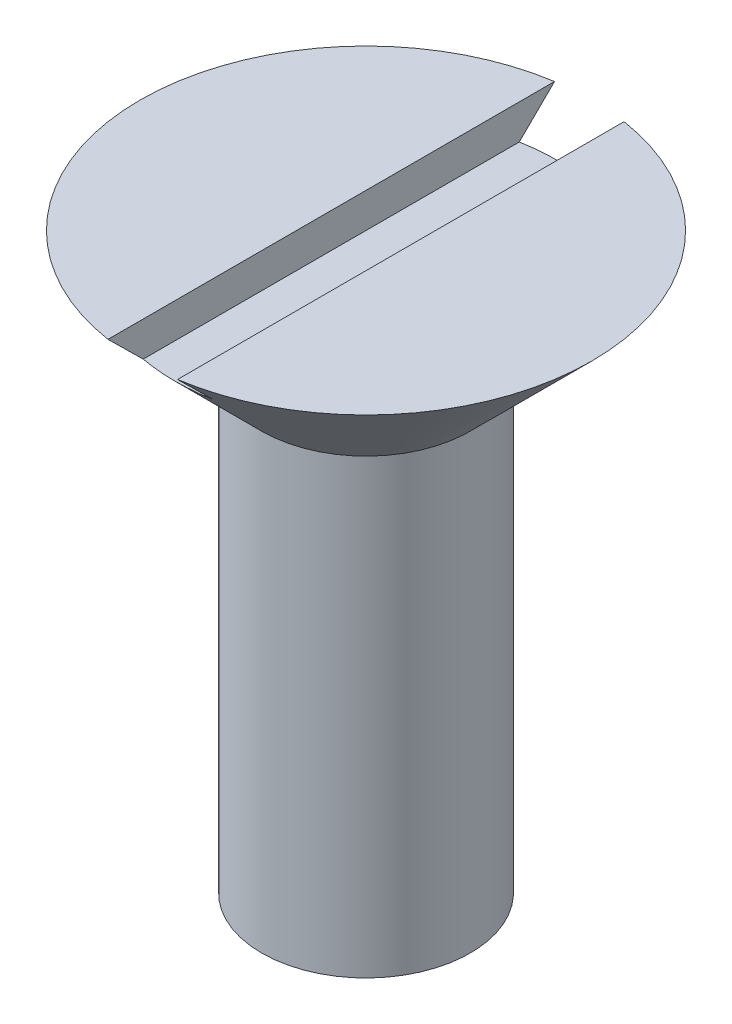
ISO-10303-21;
HEADER;
FILE_DESCRIPTION(('STEP AP214'),'2;1');
FILE_NAME('part.step','',(''),(''),'','','');
FILE_SCHEMA(('AUTOMOTIVE_DESIGN { 1 0 10303 214 1 1 1 1 }'));
ENDSEC;
DATA;
#1=APPLICATION_CONTEXT('core data for automotive mechanical design processes');
#2=APPLICATION_PROTOCOL_DEFINITION('international standard','automotive_design',2000,#1);
#3=PRODUCT_CONTEXT('',#1,'mechanical');
#4=PRODUCT('Part','Part','',(#3));
#5=PRODUCT_RELATED_PRODUCT_CATEGORY('part','',(#4));
#6=PRODUCT_DEFINITION_FORMATION('','',#4);
#7=PRODUCT_DEFINITION_CONTEXT('part definition',#1,'design');
#8=PRODUCT_DEFINITION('design','',#6,#7);
#9=PRODUCT_DEFINITION_SHAPE('','',#8);
#10=(LENGTH_UNIT() NAMED_UNIT(*) SI_UNIT(.MILLI.,.METRE.));
#11=(NAMED_UNIT(*) PLANE_ANGLE_UNIT() SI_UNIT($,.RADIAN.));
#12=(NAMED_UNIT(*) SI_UNIT($,.STERADIAN.) SOLID_ANGLE_UNIT());
#13=UNCERTAINTY_MEASURE_WITH_UNIT(LENGTH_MEASURE(1.E-05),#10,'distance_accuracy_value','');
#14=(GEOMETRIC_REPRESENTATION_CONTEXT(3) GLOBAL_UNCERTAINTY_ASSIGNED_CONTEXT((#13)) GLOBAL_UNIT_ASSIGNED_CONTEXT((#10,
#11,#12)) REPRESENTATION_CONTEXT('',''));
#15=CARTESIAN_POINT('',(0.,0.,0.));
#16=DIRECTION('',(0.,0.,1.));
#17=DIRECTION('',(1.,0.,0.));
#18=AXIS2_PLACEMENT_3D('',#15,#16,#17);
#19=CARTESIAN_POINT('',(6.5,18.2320508075688,0.));
#20=DIRECTION('',(0.,-1.,0.));
#21=DIRECTION('',(0.,0.,-1.));
#22=AXIS2_PLACEMENT_3D('',#19,#20,#21);
#23=PLANE('',#22);
#24=CARTESIAN_POINT('',(0.,18.2320508075689,0.));
#25=DIRECTION('',(0.,1.,0.));
#26=DIRECTION('',(0.,0.,1.));
#27=AXIS2_PLACEMENT_3D('',#24,#25,#26);
#28=CIRCLE('',#27,6.5);
#29=CARTESIAN_POINT('',(-1.,18.2320508075689,-6.42261628933256));
#30=VERTEX_POINT('',#29);
#31=CARTESIAN_POINT('',(-1.,18.2320508075689,6.42261628933256));
#32=VERTEX_POINT('',#31);
#33=EDGE_CURVE('E109',#30,#32,#28,.T.);
#34=ORIENTED_EDGE('',*,*,#33,.T.);
#35=DIRECTION('',(0.,0.,-1.));
#36=VECTOR('',#35,1.);
#37=CARTESIAN_POINT('',(-1.,18.2320508075688,0.));
#38=LINE('',#37,#36);
#39=EDGE_CURVE('E99',#32,#30,#38,.T.);
#40=ORIENTED_EDGE('',*,*,#39,.T.);
#41=EDGE_LOOP('',(#34,#40));
#42=FACE_BOUND('',#41,.T.);
#43=ADVANCED_FACE('F38',(#42),#23,.F.);
#44=CARTESIAN_POINT('',(0.,18.2320508075688,0.));
#45=DIRECTION('',(0.,1.,0.));
#46=DIRECTION('',(0.,0.,1.));
#47=AXIS2_PLACEMENT_3D('',#44,#45,#46);
#48=CYLINDRICAL_SURFACE('',#47,3.);
#49=CARTESIAN_POINT('',(0.,14.7320508075689,0.));
#50=DIRECTION('',(0.,1.,0.));
#51=DIRECTION('',(0.,0.,1.));
#52=AXIS2_PLACEMENT_3D('',#49,#50,#51);
#53=CIRCLE('',#52,3.);
#54=CARTESIAN_POINT('',(0.,14.7320508075689,3.));
#55=VERTEX_POINT('',#54);
#56=EDGE_CURVE('E103',#55,#55,#53,.T.);
#57=ORIENTED_EDGE('',*,*,#56,.F.);
#58=EDGE_LOOP('',(#57));
#59=FACE_BOUND('',#58,.T.);
#60=CARTESIAN_POINT('',(0.,1.73205080756885,0.));
#61=DIRECTION('',(0.,1.,0.));
#62=DIRECTION('',(0.,0.,1.));
#63=AXIS2_PLACEMENT_3D('',#60,#61,#62);
#64=CIRCLE('',#63,3.);
#65=CARTESIAN_POINT('',(0.,1.73205080756885,3.));
#66=VERTEX_POINT('',#65);
#67=EDGE_CURVE('E111',#66,#66,#64,.T.);
#68=ORIENTED_EDGE('',*,*,#67,.T.);
#69=EDGE_LOOP('',(#68));
#70=FACE_BOUND('',#69,.T.);
#71=ADVANCED_FACE('F40',(#59,#70),#48,.T.);
#72=CARTESIAN_POINT('',(0.,14.7320508075689,0.));
#73=DIRECTION('',(0.,1.,0.));
#74=DIRECTION('',(0.,0.,1.));
#75=AXIS2_PLACEMENT_3D('',#72,#73,#74);
#76=CONICAL_SURFACE('',#75,3.,0.785398163397448);
#77=CARTESIAN_POINT('',(0.,17.2320508075689,0.));
#78=DIRECTION('',(0.,-1.,0.));
#79=DIRECTION('',(0.,0.,-1.));
#80=AXIS2_PLACEMENT_3D('',#77,#78,#79);
#81=CIRCLE('',#80,5.5);
#82=CARTESIAN_POINT('',(1.,17.2320508075689,5.40832691319598));
#83=VERTEX_POINT('',#82);
#84=CARTESIAN_POINT('',(-1.,17.2320508075689,5.40832691319598));
#85=VERTEX_POINT('',#84);
#86=EDGE_CURVE('E12',#83,#85,#81,.T.);
#87=ORIENTED_EDGE('',*,*,#86,.T.);
#88=CARTESIAN_POINT('',(-1.,18.2327508075689,-6.42332472244709));
#89=CARTESIAN_POINT('',(-1.,18.048258314838,-6.23660097945427));
#90=CARTESIAN_POINT('',(-1.,17.8638535420667,-6.04979042026791));
#91=CARTESIAN_POINT('',(-1.,17.4951834773058,-5.67580075194415));
#92=CARTESIAN_POINT('',(-1.,17.3109183452467,-5.48862148517341));
#93=CARTESIAN_POINT('',(-1.,16.9405719228406,-5.11174427199789));
#94=CARTESIAN_POINT('',(-1.,16.7544945705618,-4.92204245247594));
#95=CARTESIAN_POINT('',(-1.,16.3829423371827,-4.54228085926047));
#96=CARTESIAN_POINT('',(-0.999999999999999,16.1974671533208,-4.3522213816307));
#97=CARTESIAN_POINT('',(-0.999999999999999,15.7523765807063,-3.89448779308013));
#98=CARTESIAN_POINT('',(-0.999999999999999,15.4930928757865,-3.62648996292632));
#99=CARTESIAN_POINT('',(-0.999999999999999,15.1057949245939,-3.22235847326328));
#100=CARTESIAN_POINT('',(-0.999999999999999,14.9768252376818,-3.08714155543484));
#101=CARTESIAN_POINT('',(-0.999999999999999,14.7198673013406,-2.81583986260069));
#102=CARTESIAN_POINT('',(-0.999999999999999,14.5918788208612,-2.67975530664802));
#103=CARTESIAN_POINT('',(-0.999999999999999,14.3385074829835,-2.40750996464744));
#104=CARTESIAN_POINT('',(-0.999999999999999,14.2131114794484,-2.27136147506034));
#105=CARTESIAN_POINT('',(-0.999999999999999,14.02670225425,-2.06549251852144));
#106=CARTESIAN_POINT('',(-0.999999999999999,13.9648175839809,-1.99656195550248));
#107=CARTESIAN_POINT('',(-0.999999999999999,13.8418301603246,-1.85800765522078));
#108=CARTESIAN_POINT('',(-0.999999999999999,13.7807273905447,-1.78838393254486));
#109=CARTESIAN_POINT('',(-0.999999999999999,13.6598258291561,-1.64849944827692));
#110=CARTESIAN_POINT('',(-0.999999999999999,13.6000227826117,-1.57824237330107));
#111=CARTESIAN_POINT('',(-0.999999999999999,13.4819012921253,-1.43649465507045));
#112=CARTESIAN_POINT('',(-0.999999999999999,13.4235827058344,-1.36500413120584));
#113=CARTESIAN_POINT('',(-0.999999999999999,13.3092076602417,-1.22040224759314));
#114=CARTESIAN_POINT('',(-0.999999999999999,13.2531479728324,-1.14729345020524));
#115=CARTESIAN_POINT('',(-0.999999999999999,13.1443822105344,-0.998633654183111));
#116=CARTESIAN_POINT('',(-0.999999999999999,13.0916741073346,-0.923084175167183));
#117=CARTESIAN_POINT('',(-0.999999999999999,13.029464499087,-0.826733268002395));
#118=CARTESIAN_POINT('',(-0.999999999999999,13.0173570878445,-0.807613449628516));
#119=CARTESIAN_POINT('',(-0.999999999999999,12.9935307382733,-0.769130032509415));
#120=CARTESIAN_POINT('',(-0.999999999999999,12.9818118501907,-0.749766402676444));
#121=CARTESIAN_POINT('',(-0.999999999999999,12.9473166769411,-0.691277443855445));
#122=CARTESIAN_POINT('',(-0.999999999999999,12.9252031665011,-0.651756012110414));
#123=CARTESIAN_POINT('',(-0.999999999999999,12.8834834950286,-0.571795836460224));
#124=CARTESIAN_POINT('',(-0.999999999999999,12.8638587563594,-0.53136691305942));
#125=CARTESIAN_POINT('',(-0.999999999999999,12.827672295261,-0.449164527118064));
#126=CARTESIAN_POINT('',(-0.999999999999999,12.8111096444342,-0.407391476629312));
#127=CARTESIAN_POINT('',(-0.999999999999999,12.7765767196698,-0.306630339616185));
#128=CARTESIAN_POINT('',(-0.999999999999999,12.760365134203,-0.24700670038359));
#129=CARTESIAN_POINT('',(-0.999999999999999,12.7382220960758,-0.125997310764456));
#130=CARTESIAN_POINT('',(-0.999999999999999,12.7322529706765,-0.064618865695032));
#131=CARTESIAN_POINT('',(-0.999999999999999,12.7318582889359,0.0584045004398401));
#132=CARTESIAN_POINT('',(-0.999999999999999,12.7374748954144,0.120049577222187));
#133=CARTESIAN_POINT('',(-0.999999999999999,12.7590603018905,0.241594604406583));
#134=CARTESIAN_POINT('',(-0.999999999999999,12.7750642998389,0.301487895031282));
#135=CARTESIAN_POINT('',(-0.999999999999999,12.8162962514927,0.423255248595593));
#136=CARTESIAN_POINT('',(-0.999999999999999,12.8421594283309,0.484904761598882));
#137=CARTESIAN_POINT('',(-0.999999999999999,12.8998302431121,0.605404375291085));
#138=CARTESIAN_POINT('',(-0.999999999999999,12.9316492762217,0.664248833759913));
#139=CARTESIAN_POINT('',(-0.999999999999999,12.9994497478926,0.780076722377037));
#140=CARTESIAN_POINT('',(-0.999999999999999,13.035462170041,0.837041711978566));
#141=CARTESIAN_POINT('',(-0.999999999999999,13.0914660134139,0.921108655798607));
#142=CARTESIAN_POINT('',(-0.999999999999999,13.1104564002888,0.948889451470525));
#143=CARTESIAN_POINT('',(-0.999999999999999,13.1489991130449,1.00405791508452));
#144=CARTESIAN_POINT('',(-0.999999999999999,13.1685514227085,1.03144559433802));
#145=CARTESIAN_POINT('',(-0.999999999999999,13.2315737708694,1.11814350022163));
#146=CARTESIAN_POINT('',(-0.999999999999999,13.275923795756,1.17681365371047));
#147=CARTESIAN_POINT('',(-0.999999999999999,13.3661824388033,1.29294612386852));
#148=CARTESIAN_POINT('',(-0.999999999999999,13.4120912977265,1.35040825171825));
#149=CARTESIAN_POINT('',(-0.999999999999999,13.5515277518446,1.52148386035253));
#150=CARTESIAN_POINT('',(-0.999999999999999,13.6467249785959,1.6337330529775));
#151=CARTESIAN_POINT('',(-0.999999999999999,13.8397906777721,1.85622604953615));
#152=CARTESIAN_POINT('',(-0.999999999999999,13.9376635314479,1.96646600221244));
#153=CARTESIAN_POINT('',(-0.999999999999999,14.1349763729932,2.18547633450563));
#154=CARTESIAN_POINT('',(-0.999999999999999,14.2344159147301,2.29424711666656));
#155=CARTESIAN_POINT('',(-0.999999999999999,14.4340193076452,2.51044729255304));
#156=CARTESIAN_POINT('',(-0.999999999999999,14.5341796340868,2.61787995144472));
#157=CARTESIAN_POINT('',(-0.999999999999999,14.7352479273891,2.83205668510756));
#158=CARTESIAN_POINT('',(-0.999999999999999,14.8361559460881,2.93880071115698));
#159=CARTESIAN_POINT('',(-0.999999999999999,15.1394817518798,3.25807348248408));
#160=CARTESIAN_POINT('',(-0.999999999999999,15.3426924464419,3.46984818145692));
#161=CARTESIAN_POINT('',(-0.999999999999999,15.7686020278122,3.91117980862652));
#162=CARTESIAN_POINT('',(-0.999999999999999,15.9914137080192,4.14062755160493));
#163=CARTESIAN_POINT('',(-0.999999999999999,16.4379857347408,4.59874114188859));
#164=CARTESIAN_POINT('',(-1.,16.6617463629717,4.8274067143862));
#165=CARTESIAN_POINT('',(-1.,17.1098622834829,5.28420548161042));
#166=CARTESIAN_POINT('',(-1.,17.3342176411328,5.51233861215154));
#167=CARTESIAN_POINT('',(-1.,17.7832587311606,5.96812929258623));
#168=CARTESIAN_POINT('',(-1.,18.0079443279816,6.19578697599764));
#169=CARTESIAN_POINT('',(-1.,18.2327508075689,6.42332472244709));
#170=B_SPLINE_CURVE_WITH_KNOTS('',3,(#88,#89,#90,#91,#92,#93,#94,#95,#96,#97,#98,#99,#100,#101,
#102,#103,#104,#105,#106,#107,#108,#109,#110,#111,#112,#113,#114,#115,#116,#117,#118,#119,#120,
#121,#122,#123,#124,#125,#126,#127,#128,#129,#130,#131,#132,#133,#134,#135,#136,#137,#138,#139,
#140,#141,#142,#143,#144,#145,#146,#147,#148,#149,#150,#151,#152,#153,#154,#155,#156,#157,#158,
#159,#160,#161,#162,#163,#164,#165,#166,#167,#168,#169),.UNSPECIFIED.,.F.,.F.,(4,2,2,2,2,2,2,2,
2,2,2,2,2,2,2,2,2,2,2,2,2,2,2,2,2,2,2,2,2,2,2,2,2,2,2,2,2,2,2,2,4),(0.,0.78748287909109,
1.57545946982074,2.37264371237518,3.16933207457063,4.28800672997833,4.84858456810997,
5.40902607813936,5.96429483881583,6.24219393443101,6.52008719426129,6.79686319025391,
7.07361254470394,7.34995126360952,7.62612112424391,7.69400967717524,7.7619069758642,
7.89770861286132,8.03242799072323,8.1671064556528,8.35176568840787,8.53574425942204,
8.72039354672401,8.90567181282054,9.10576489619662,9.30624479924503,9.50831322811275,
9.60926230610501,9.71020847356945,9.93080591781796,10.1514375897978,10.5929016423221,
11.0351379005564,11.477250424866,11.9178874921872,12.3585554006096,13.2390498022861,
14.1985373102661,15.1583329960948,16.1182389566303,17.0778239415921),.UNSPECIFIED.);
#171=EDGE_CURVE('E114',#85,#32,#170,.T.);
#172=ORIENTED_EDGE('',*,*,#171,.T.);
#173=ORIENTED_EDGE('',*,*,#33,.F.);
#174=CARTESIAN_POINT('',(-1.,17.2320508075689,-5.40832691319598));
#175=VERTEX_POINT('',#174);
#176=EDGE_CURVE('E98',#30,#175,#170,.T.);
#177=ORIENTED_EDGE('',*,*,#176,.T.);
#178=CARTESIAN_POINT('',(1.,17.2320508075689,-5.40832691319598));
#179=VERTEX_POINT('',#178);
#180=EDGE_CURVE('E42',#175,#179,#81,.T.);
#181=ORIENTED_EDGE('',*,*,#180,.T.);
#182=CARTESIAN_POINT('',(1.,18.2327508075689,6.42332472244709));
#183=CARTESIAN_POINT('',(1.,18.048258314838,6.23660097945427));
#184=CARTESIAN_POINT('',(1.,17.8638535420667,6.04979042026791));
#185=CARTESIAN_POINT('',(1.,17.4951834773058,5.67580075194415));
#186=CARTESIAN_POINT('',(1.,17.3109183452467,5.48862148517341));
#187=CARTESIAN_POINT('',(1.,16.9405719228406,5.11174427199789));
#188=CARTESIAN_POINT('',(0.999999999999999,16.7544945705618,4.92204245247595));
#189=CARTESIAN_POINT('',(0.999999999999999,16.3829423371827,4.54228085926048));
#190=CARTESIAN_POINT('',(0.999999999999999,16.1974671533209,4.35222138163071));
#191=CARTESIAN_POINT('',(0.999999999999999,15.7523765807063,3.89448779308014));
#192=CARTESIAN_POINT('',(0.999999999999999,15.4930928757865,3.62648996292633));
#193=CARTESIAN_POINT('',(0.999999999999999,15.1057949245939,3.22235847326328));
#194=CARTESIAN_POINT('',(0.999999999999999,14.9768252376818,3.08714155543485));
#195=CARTESIAN_POINT('',(0.999999999999999,14.7198673013406,2.81583986260069));
#196=CARTESIAN_POINT('',(0.999999999999999,14.5918788208613,2.67975530664803));
#197=CARTESIAN_POINT('',(0.999999999999999,14.3385074829835,2.40750996464745));
#198=CARTESIAN_POINT('',(0.999999999999999,14.2131114794484,2.27136147506035));
#199=CARTESIAN_POINT('',(0.999999999999999,14.02670225425,2.06549251852144));
#200=CARTESIAN_POINT('',(0.999999999999999,13.9648175839809,1.99656195550249));
#201=CARTESIAN_POINT('',(0.999999999999999,13.8418301603246,1.85800765522079));
#202=CARTESIAN_POINT('',(0.999999999999999,13.7807273905447,1.78838393254487));
#203=CARTESIAN_POINT('',(0.999999999999999,13.6598258291561,1.64849944827692));
#204=CARTESIAN_POINT('',(0.999999999999998,13.6000227826117,1.57824237330107));
#205=CARTESIAN_POINT('',(0.999999999999998,13.4819012921253,1.43649465507045));
#206=CARTESIAN_POINT('',(0.999999999999998,13.4235827058345,1.36500413120584));
#207=CARTESIAN_POINT('',(0.999999999999998,13.3092076602417,1.22040224759314));
#208=CARTESIAN_POINT('',(0.999999999999998,13.2531479728324,1.14729345020524));
#209=CARTESIAN_POINT('',(0.999999999999998,13.1443822105344,0.998633654183114));
#210=CARTESIAN_POINT('',(0.999999999999998,13.0916741073346,0.923084175167184));
#211=CARTESIAN_POINT('',(0.999999999999998,13.029464499087,0.826733268002396));
#212=CARTESIAN_POINT('',(0.999999999999998,13.0173570878445,0.807613449628516));
#213=CARTESIAN_POINT('',(0.999999999999998,12.9935307382733,0.769130032509415));
#214=CARTESIAN_POINT('',(0.999999999999998,12.9818118501907,0.749766402676444));
#215=CARTESIAN_POINT('',(0.999999999999998,12.9473166769411,0.691277443855446));
#216=CARTESIAN_POINT('',(0.999999999999998,12.9252031665011,0.651756012110415));
#217=CARTESIAN_POINT('',(0.999999999999998,12.8834834950286,0.571795836460226));
#218=CARTESIAN_POINT('',(0.999999999999998,12.8638587563594,0.531366913059422));
#219=CARTESIAN_POINT('',(0.999999999999998,12.827672295261,0.449164527118066));
#220=CARTESIAN_POINT('',(0.999999999999998,12.8111096444342,0.407391476629314));
#221=CARTESIAN_POINT('',(0.999999999999998,12.7765767196698,0.306630339616187));
#222=CARTESIAN_POINT('',(0.999999999999998,12.760365134203,0.247006700383593));
#223=CARTESIAN_POINT('',(0.999999999999998,12.7382220960758,0.125997310764458));
#224=CARTESIAN_POINT('',(0.999999999999998,12.7322529706765,0.0646188656950334));
#225=CARTESIAN_POINT('',(0.999999999999998,12.7318582889359,-0.0584045004398392));
#226=CARTESIAN_POINT('',(0.999999999999998,12.7374748954144,-0.120049577222186));
#227=CARTESIAN_POINT('',(0.999999999999998,12.7590603018905,-0.241594604406582));
#228=CARTESIAN_POINT('',(0.999999999999998,12.7750642998389,-0.301487895031282));
#229=CARTESIAN_POINT('',(0.999999999999998,12.8162962514927,-0.423255248595592));
#230=CARTESIAN_POINT('',(0.999999999999998,12.8421594283309,-0.484904761598881));
#231=CARTESIAN_POINT('',(0.999999999999998,12.8998302431121,-0.605404375291085));
#232=CARTESIAN_POINT('',(0.999999999999998,12.9316492762217,-0.664248833759913));
#233=CARTESIAN_POINT('',(0.999999999999998,12.9994497478926,-0.780076722377037));
#234=CARTESIAN_POINT('',(0.999999999999998,13.035462170041,-0.837041711978566));
#235=CARTESIAN_POINT('',(0.999999999999998,13.0914660134139,-0.921108655798607));
#236=CARTESIAN_POINT('',(0.999999999999998,13.1104564002888,-0.948889451470525));
#237=CARTESIAN_POINT('',(0.999999999999998,13.1489991130449,-1.00405791508452));
#238=CARTESIAN_POINT('',(0.999999999999998,13.1685514227085,-1.03144559433802));
#239=CARTESIAN_POINT('',(0.999999999999998,13.2315737708694,-1.11814350022163));
#240=CARTESIAN_POINT('',(0.999999999999998,13.275923795756,-1.17681365371047));
#241=CARTESIAN_POINT('',(0.999999999999998,13.3661824388033,-1.29294612386852));
#242=CARTESIAN_POINT('',(0.999999999999998,13.4120912977265,-1.35040825171825));
#243=CARTESIAN_POINT('',(0.999999999999998,13.5515277518446,-1.52148386035253));
#244=CARTESIAN_POINT('',(0.999999999999999,13.6467249785959,-1.6337330529775));
#245=CARTESIAN_POINT('',(0.999999999999999,13.8397906777721,-1.85622604953615));
#246=CARTESIAN_POINT('',(0.999999999999999,13.9376635314479,-1.96646600221244));
#247=CARTESIAN_POINT('',(0.999999999999999,14.1349763729932,-2.18547633450563));
#248=CARTESIAN_POINT('',(0.999999999999999,14.2344159147301,-2.29424711666656));
#249=CARTESIAN_POINT('',(0.999999999999999,14.4340193076452,-2.51044729255304));
#250=CARTESIAN_POINT('',(0.999999999999999,14.5341796340868,-2.61787995144472));
#251=CARTESIAN_POINT('',(0.999999999999999,14.7352479273891,-2.83205668510756));
#252=CARTESIAN_POINT('',(0.999999999999999,14.8361559460881,-2.93880071115698));
#253=CARTESIAN_POINT('',(0.999999999999999,15.1394817518798,-3.25807348248408));
#254=CARTESIAN_POINT('',(0.999999999999999,15.3426924464419,-3.46984818145692));
#255=CARTESIAN_POINT('',(0.999999999999999,15.7686020278122,-3.91117980862651));
#256=CARTESIAN_POINT('',(0.999999999999999,15.9914137080192,-4.14062755160493));
#257=CARTESIAN_POINT('',(0.999999999999999,16.4379857347408,-4.59874114188859));
#258=CARTESIAN_POINT('',(0.999999999999999,16.6617463629717,-4.82740671438619));
#259=CARTESIAN_POINT('',(0.999999999999999,17.1098622834829,-5.28420548161042));
#260=CARTESIAN_POINT('',(1.,17.3342176411328,-5.51233861215154));
#261=CARTESIAN_POINT('',(1.,17.7832587311606,-5.96812929258623));
#262=CARTESIAN_POINT('',(1.,18.0079443279816,-6.19578697599764));
#263=CARTESIAN_POINT('',(1.,18.2327508075689,-6.42332472244709));
#264=B_SPLINE_CURVE_WITH_KNOTS('',3,(#182,#183,#184,#185,#186,#187,#188,#189,#190,#191,#192,
#193,#194,#195,#196,#197,#198,#199,#200,#201,#202,#203,#204,#205,#206,#207,#208,#209,#210,#211,
#212,#213,#214,#215,#216,#217,#218,#219,#220,#221,#222,#223,#224,#225,#226,#227,#228,#229,#230,
#231,#232,#233,#234,#235,#236,#237,#238,#239,#240,#241,#242,#243,#244,#245,#246,#247,#248,#249,
#250,#251,#252,#253,#254,#255,#256,#257,#258,#259,#260,#261,#262,#263),.UNSPECIFIED.,.F.,.F.,(4,
2,2,2,2,2,2,2,2,2,2,2,2,2,2,2,2,2,2,2,2,2,2,2,2,2,2,2,2,2,2,2,2,2,2,2,2,2,2,2,4),(0.,
0.78748287909109,1.57545946982073,2.37264371237517,3.16933207457061,4.28800672997832,
4.84858456810996,5.40902607813935,5.96429483881582,6.242193934431,6.52008719426129,
6.79686319025391,7.07361254470393,7.34995126360952,7.62612112424391,7.69400967717524,
7.7619069758642,7.89770861286132,8.03242799072323,8.16710645565279,8.35176568840786,
8.53574425942204,8.72039354672401,8.90567181282054,9.10576489619662,9.30624479924504,
9.50831322811275,9.60926230610501,9.71020847356945,9.93080591781796,10.1514375897978,
10.5929016423221,11.0351379005564,11.477250424866,11.9178874921872,12.3585554006096,
13.2390498022861,14.1985373102661,15.1583329960948,16.1182389566303,17.0778239415921),.UNSPECIFIED.);
#265=CARTESIAN_POINT('',(1.,18.2320508075689,-6.42261628933256));
#266=VERTEX_POINT('',#265);
#267=EDGE_CURVE('E78',#179,#266,#264,.T.);
#268=ORIENTED_EDGE('',*,*,#267,.T.);
#269=CARTESIAN_POINT('',(1.,18.2320508075689,6.42261628933256));
#270=VERTEX_POINT('',#269);
#271=EDGE_CURVE('E108',#270,#266,#28,.T.);
#272=ORIENTED_EDGE('',*,*,#271,.F.);
#273=EDGE_CURVE('E53',#270,#83,#264,.T.);
#274=ORIENTED_EDGE('',*,*,#273,.T.);
#275=EDGE_LOOP('',(#87,#172,#173,#177,#181,#268,#272,#274));
#276=FACE_BOUND('',#275,.T.);
#277=ORIENTED_EDGE('',*,*,#56,.T.);
#278=EDGE_LOOP('',(#277));
#279=FACE_BOUND('',#278,.T.);
#280=ADVANCED_FACE('F95',(#276,#279),#76,.T.);
#281=ORIENTED_EDGE('',*,*,#271,.T.);
#282=DIRECTION('',(0.,0.,1.));
#283=VECTOR('',#282,1.);
#284=CARTESIAN_POINT('',(1.,18.2320508075688,0.));
#285=LINE('',#284,#283);
#286=EDGE_CURVE('E82',#266,#270,#285,.T.);
#287=ORIENTED_EDGE('',*,*,#286,.T.);
#288=EDGE_LOOP('',(#281,#287));
#289=FACE_BOUND('',#288,.T.);
#290=ADVANCED_FACE('F137',(#289),#23,.F.);
#291=CARTESIAN_POINT('',(0.,0.,0.));
#292=DIRECTION('',(0.,1.,0.));
#293=DIRECTION('',(0.,0.,1.));
#294=AXIS2_PLACEMENT_3D('',#291,#292,#293);
#295=CONICAL_SURFACE('',#294,0.,1.0471975511966);
#296=ORIENTED_EDGE('',*,*,#67,.F.);
#297=EDGE_LOOP('',(#296));
#298=FACE_BOUND('',#297,.T.);
#299=CARTESIAN_POINT('',(0.,0.,0.));
#300=VERTEX_POINT('',#299);
#301=VERTEX_LOOP('',#300);
#302=FACE_BOUND('',#301,.T.);
#303=ADVANCED_FACE('F135',(#298,#302),#295,.T.);
#304=CARTESIAN_POINT('',(-1.,17.2320508075689,-6.5));
#305=DIRECTION('',(0.,-1.,0.));
#306=DIRECTION('',(0.,0.,-1.));
#307=AXIS2_PLACEMENT_3D('',#304,#305,#306);
#308=PLANE('',#307);
#309=DIRECTION('',(0.,0.,1.));
#310=VECTOR('',#309,1.);
#311=CARTESIAN_POINT('',(1.,17.2320508075689,-6.5));
#312=LINE('',#311,#310);
#313=EDGE_CURVE('E81',#179,#83,#312,.T.);
#314=ORIENTED_EDGE('',*,*,#313,.F.);
#315=ORIENTED_EDGE('',*,*,#180,.F.);
#316=DIRECTION('',(0.,0.,1.));
#317=VECTOR('',#316,1.);
#318=CARTESIAN_POINT('',(-1.,17.2320508075689,-6.5));
#319=LINE('',#318,#317);
#320=EDGE_CURVE('E92',#175,#85,#319,.T.);
#321=ORIENTED_EDGE('',*,*,#320,.T.);
#322=ORIENTED_EDGE('',*,*,#86,.F.);
#323=EDGE_LOOP('',(#314,#315,#321,#322));
#324=FACE_BOUND('',#323,.T.);
#325=ADVANCED_FACE('F89',(#324),#308,.F.);
#326=CARTESIAN_POINT('',(-1.,19.2320508075689,-6.5));
#327=DIRECTION('',(-1.,0.,0.));
#328=DIRECTION('',(0.,-1.,0.));
#329=AXIS2_PLACEMENT_3D('',#326,#327,#328);
#330=PLANE('',#329);
#331=ORIENTED_EDGE('',*,*,#39,.F.);
#332=ORIENTED_EDGE('',*,*,#171,.F.);
#333=ORIENTED_EDGE('',*,*,#320,.F.);
#334=ORIENTED_EDGE('',*,*,#176,.F.);
#335=EDGE_LOOP('',(#331,#332,#333,#334));
#336=FACE_BOUND('',#335,.T.);
#337=ADVANCED_FACE('F129',(#336),#330,.F.);
#338=CARTESIAN_POINT('',(1.,19.2320508075689,-6.5));
#339=DIRECTION('',(1.,0.,0.));
#340=DIRECTION('',(0.,1.,0.));
#341=AXIS2_PLACEMENT_3D('',#338,#339,#340);
#342=PLANE('',#341);
#343=ORIENTED_EDGE('',*,*,#286,.F.);
#344=ORIENTED_EDGE('',*,*,#267,.F.);
#345=ORIENTED_EDGE('',*,*,#313,.T.);
#346=ORIENTED_EDGE('',*,*,#273,.F.);
#347=EDGE_LOOP('',(#343,#344,#345,#346));
#348=FACE_BOUND('',#347,.T.);
#349=ADVANCED_FACE('F80',(#348),#342,.F.);
#350=CLOSED_SHELL('',(#43,#71,#280,#290,#303,#325,#337,#349));
#351=MANIFOLD_SOLID_BREP('B2',#350);
#352=ADVANCED_BREP_SHAPE_REPRESENTATION('',(#18,#351),#14);
#353=SHAPE_DEFINITION_REPRESENTATION(#9,#352);
ENDSEC;
END-ISO-10303-21;
